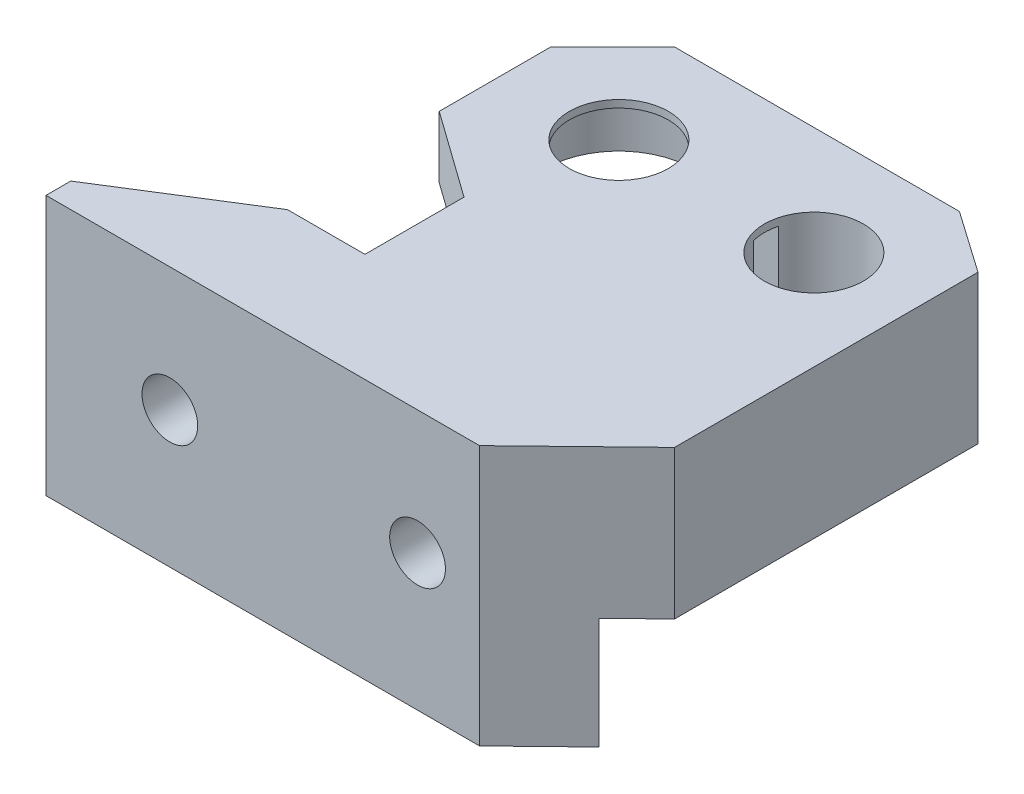
ISO-10303-21;
HEADER;
FILE_DESCRIPTION(('STEP AP214'),'2;1');
FILE_NAME('part.step','',(''),(''),'','','');
FILE_SCHEMA(('AUTOMOTIVE_DESIGN { 1 0 10303 214 1 1 1 1 }'));
ENDSEC;
DATA;
#1=APPLICATION_CONTEXT('core data for automotive mechanical design processes');
#2=APPLICATION_PROTOCOL_DEFINITION('international standard','automotive_design',2000,#1);
#3=PRODUCT_CONTEXT('',#1,'mechanical');
#4=PRODUCT('Part','Part','',(#3));
#5=PRODUCT_RELATED_PRODUCT_CATEGORY('part','',(#4));
#6=PRODUCT_DEFINITION_FORMATION('','',#4);
#7=PRODUCT_DEFINITION_CONTEXT('part definition',#1,'design');
#8=PRODUCT_DEFINITION('design','',#6,#7);
#9=PRODUCT_DEFINITION_SHAPE('','',#8);
#10=(LENGTH_UNIT() NAMED_UNIT(*) SI_UNIT(.MILLI.,.METRE.));
#11=(NAMED_UNIT(*) PLANE_ANGLE_UNIT() SI_UNIT($,.RADIAN.));
#12=(NAMED_UNIT(*) SI_UNIT($,.STERADIAN.) SOLID_ANGLE_UNIT());
#13=UNCERTAINTY_MEASURE_WITH_UNIT(LENGTH_MEASURE(1.E-05),#10,'distance_accuracy_value','');
#14=(GEOMETRIC_REPRESENTATION_CONTEXT(3) GLOBAL_UNCERTAINTY_ASSIGNED_CONTEXT((#13)) GLOBAL_UNIT_ASSIGNED_CONTEXT((#10,
#11,#12)) REPRESENTATION_CONTEXT('',''));
#15=CARTESIAN_POINT('',(0.,0.,0.));
#16=DIRECTION('',(0.,0.,1.));
#17=DIRECTION('',(1.,0.,0.));
#18=AXIS2_PLACEMENT_3D('',#15,#16,#17);
#19=CARTESIAN_POINT('',(-9.25,-5.,-8.75));
#20=DIRECTION('',(0.,0.,1.));
#21=DIRECTION('',(1.,0.,0.));
#22=AXIS2_PLACEMENT_3D('',#19,#20,#21);
#23=CYLINDRICAL_SURFACE('',#22,2.25);
#24=CARTESIAN_POINT('',(-9.25,-5.,27.));
#25=DIRECTION('',(0.,0.,1.));
#26=DIRECTION('',(1.,0.,0.));
#27=AXIS2_PLACEMENT_3D('',#24,#25,#26);
#28=CIRCLE('',#27,2.25);
#29=CARTESIAN_POINT('',(-7.,-5.,27.));
#30=VERTEX_POINT('',#29);
#31=EDGE_CURVE('E582',#30,#30,#28,.T.);
#32=ORIENTED_EDGE('',*,*,#31,.T.);
#33=EDGE_LOOP('',(#32));
#34=FACE_BOUND('',#33,.T.);
#35=CARTESIAN_POINT('',(-9.25,-5.,22.25));
#36=DIRECTION('',(0.,0.,1.));
#37=DIRECTION('',(1.,0.,0.));
#38=AXIS2_PLACEMENT_3D('',#35,#36,#37);
#39=CIRCLE('',#38,2.25);
#40=CARTESIAN_POINT('',(-7.,-5.,22.25));
#41=VERTEX_POINT('',#40);
#42=EDGE_CURVE('E43',#41,#41,#39,.T.);
#43=ORIENTED_EDGE('',*,*,#42,.F.);
#44=EDGE_LOOP('',(#43));
#45=FACE_BOUND('',#44,.T.);
#46=ADVANCED_FACE('F35',(#34,#45),#23,.F.);
#47=CARTESIAN_POINT('',(10.75,-5.,-8.75));
#48=DIRECTION('',(0.,0.,1.));
#49=DIRECTION('',(1.,0.,0.));
#50=AXIS2_PLACEMENT_3D('',#47,#48,#49);
#51=CYLINDRICAL_SURFACE('',#50,2.25);
#52=CARTESIAN_POINT('',(10.75,-5.,27.));
#53=DIRECTION('',(0.,0.,1.));
#54=DIRECTION('',(1.,0.,0.));
#55=AXIS2_PLACEMENT_3D('',#52,#53,#54);
#56=CIRCLE('',#55,2.25);
#57=CARTESIAN_POINT('',(13.,-5.,27.));
#58=VERTEX_POINT('',#57);
#59=EDGE_CURVE('E583',#58,#58,#56,.T.);
#60=ORIENTED_EDGE('',*,*,#59,.T.);
#61=EDGE_LOOP('',(#60));
#62=FACE_BOUND('',#61,.T.);
#63=CARTESIAN_POINT('',(10.75,-5.,22.25));
#64=DIRECTION('',(0.,0.,1.));
#65=DIRECTION('',(1.,0.,0.));
#66=AXIS2_PLACEMENT_3D('',#63,#64,#65);
#67=CIRCLE('',#66,2.25);
#68=CARTESIAN_POINT('',(13.,-5.,22.25));
#69=VERTEX_POINT('',#68);
#70=EDGE_CURVE('E11',#69,#69,#67,.T.);
#71=ORIENTED_EDGE('',*,*,#70,.F.);
#72=EDGE_LOOP('',(#71));
#73=FACE_BOUND('',#72,.T.);
#74=ADVANCED_FACE('F376',(#62,#73),#51,.F.);
#75=CARTESIAN_POINT('',(0.,-7.,0.));
#76=DIRECTION('',(0.,1.,0.));
#77=DIRECTION('',(0.,0.,1.));
#78=AXIS2_PLACEMENT_3D('',#75,#76,#77);
#79=PLANE('',#78);
#80=DIRECTION('',(1.,0.,0.));
#81=VECTOR('',#80,1.);
#82=CARTESIAN_POINT('',(20.25,-7.,18.25));
#83=LINE('',#82,#81);
#84=CARTESIAN_POINT('',(-5.78589838486224,-7.,18.25));
#85=VERTEX_POINT('',#84);
#86=CARTESIAN_POINT('',(7.28589838486225,-7.,18.25));
#87=VERTEX_POINT('',#86);
#88=EDGE_CURVE('E251',#85,#87,#83,.T.);
#89=ORIENTED_EDGE('',*,*,#88,.T.);
#90=DIRECTION('',(0.,0.,-1.));
#91=VECTOR('',#90,1.);
#92=CARTESIAN_POINT('',(7.28589838486225,-7.,22.25));
#93=LINE('',#92,#91);
#94=CARTESIAN_POINT('',(7.28589838486225,-7.,22.25));
#95=VERTEX_POINT('',#94);
#96=EDGE_CURVE('E229',#87,#95,#93,.F.);
#97=ORIENTED_EDGE('',*,*,#96,.T.);
#98=DIRECTION('',(-1.,0.,0.));
#99=VECTOR('',#98,1.);
#100=CARTESIAN_POINT('',(-14.8703703703704,-7.,22.25));
#101=LINE('',#100,#99);
#102=CARTESIAN_POINT('',(-5.78589838486224,-7.,22.25));
#103=VERTEX_POINT('',#102);
#104=EDGE_CURVE('E557',#95,#103,#101,.T.);
#105=ORIENTED_EDGE('',*,*,#104,.T.);
#106=DIRECTION('',(0.,0.,-1.));
#107=VECTOR('',#106,1.);
#108=CARTESIAN_POINT('',(-5.78589838486224,-7.,22.25));
#109=LINE('',#108,#107);
#110=EDGE_CURVE('E244',#103,#85,#109,.T.);
#111=ORIENTED_EDGE('',*,*,#110,.T.);
#112=EDGE_LOOP('',(#89,#97,#105,#111));
#113=FACE_BOUND('',#112,.T.);
#114=ADVANCED_FACE('F382',(#113),#79,.F.);
#115=DIRECTION('',(0.846889988853068,0.,-0.531768132535647));
#116=VECTOR('',#115,1.);
#117=CARTESIAN_POINT('',(-8.5,-7.,18.25));
#118=LINE('',#117,#116);
#119=CARTESIAN_POINT('',(-14.8703703703704,-7.,22.25));
#120=VERTEX_POINT('',#119);
#121=CARTESIAN_POINT('',(-12.7141016151378,-7.,20.8960638048539));
#122=VERTEX_POINT('',#121);
#123=EDGE_CURVE('E252',#120,#122,#118,.T.);
#124=ORIENTED_EDGE('',*,*,#123,.T.);
#125=DIRECTION('',(0.,0.,-1.));
#126=VECTOR('',#125,1.);
#127=CARTESIAN_POINT('',(-12.7141016151378,-7.,22.25));
#128=LINE('',#127,#126);
#129=CARTESIAN_POINT('',(-12.7141016151378,-7.,22.25));
#130=VERTEX_POINT('',#129);
#131=EDGE_CURVE('E563',#122,#130,#128,.F.);
#132=ORIENTED_EDGE('',*,*,#131,.T.);
#133=EDGE_CURVE('E556',#130,#120,#101,.T.);
#134=ORIENTED_EDGE('',*,*,#133,.T.);
#135=EDGE_LOOP('',(#124,#132,#134));
#136=FACE_BOUND('',#135,.T.);
#137=ADVANCED_FACE('F424',(#136),#79,.F.);
#138=CARTESIAN_POINT('',(15.75,5.,0.));
#139=DIRECTION('',(0.,-1.,0.));
#140=DIRECTION('',(0.,0.,-1.));
#141=AXIS2_PLACEMENT_3D('',#138,#139,#140);
#142=CYLINDRICAL_SURFACE('',#141,4.);
#143=CARTESIAN_POINT('',(15.75,5.,0.));
#144=DIRECTION('',(0.,1.,0.));
#145=DIRECTION('',(0.,0.,1.));
#146=AXIS2_PLACEMENT_3D('',#143,#144,#145);
#147=CIRCLE('',#146,4.);
#148=CARTESIAN_POINT('',(15.75,5.,4.));
#149=VERTEX_POINT('',#148);
#150=EDGE_CURVE('E282',#149,#149,#147,.T.);
#151=ORIENTED_EDGE('',*,*,#150,.T.);
#152=EDGE_LOOP('',(#151));
#153=FACE_BOUND('',#152,.T.);
#154=DIRECTION('',(0.,-1.,0.));
#155=VECTOR('',#154,1.);
#156=CARTESIAN_POINT('',(11.8770166537926,5.,-1.));
#157=LINE('',#156,#155);
#158=CARTESIAN_POINT('',(11.8770166537926,-2.5,-1.));
#159=VERTEX_POINT('',#158);
#160=CARTESIAN_POINT('',(11.8770166537926,4.4,-1.));
#161=VERTEX_POINT('',#160);
#162=EDGE_CURVE('E363',#159,#161,#157,.F.);
#163=ORIENTED_EDGE('',*,*,#162,.F.);
#164=CARTESIAN_POINT('',(15.75,-2.5,0.));
#165=DIRECTION('',(0.,-1.,0.));
#166=DIRECTION('',(0.,0.,-1.));
#167=AXIS2_PLACEMENT_3D('',#164,#165,#166);
#168=CIRCLE('',#167,4.);
#169=CARTESIAN_POINT('',(11.8770166537926,-2.5,0.999999999999999));
#170=VERTEX_POINT('',#169);
#171=EDGE_CURVE('E525',#159,#170,#168,.T.);
#172=ORIENTED_EDGE('',*,*,#171,.T.);
#173=DIRECTION('',(0.,-1.,0.));
#174=VECTOR('',#173,1.);
#175=CARTESIAN_POINT('',(11.8770166537926,5.,1.));
#176=LINE('',#175,#174);
#177=CARTESIAN_POINT('',(11.8770166537926,4.4,1.));
#178=VERTEX_POINT('',#177);
#179=EDGE_CURVE('E365',#178,#170,#176,.T.);
#180=ORIENTED_EDGE('',*,*,#179,.F.);
#181=CARTESIAN_POINT('',(15.75,4.4,0.));
#182=DIRECTION('',(0.,-1.,0.));
#183=DIRECTION('',(0.,0.,-1.));
#184=AXIS2_PLACEMENT_3D('',#181,#182,#183);
#185=CIRCLE('',#184,4.);
#186=EDGE_CURVE('E367',#178,#161,#185,.T.);
#187=ORIENTED_EDGE('',*,*,#186,.T.);
#188=EDGE_LOOP('',(#163,#172,#180,#187));
#189=FACE_BOUND('',#188,.T.);
#190=ADVANCED_FACE('F409',(#153,#189),#142,.F.);
#191=CARTESIAN_POINT('',(15.75,-2.5,0.));
#192=DIRECTION('',(0.,-1.,0.));
#193=DIRECTION('',(0.,0.,-1.));
#194=AXIS2_PLACEMENT_3D('',#191,#192,#193);
#195=PLANE('',#194);
#196=ORIENTED_EDGE('',*,*,#171,.F.);
#197=DIRECTION('',(-1.,0.,0.));
#198=VECTOR('',#197,1.);
#199=CARTESIAN_POINT('',(15.75,-2.5,-1.));
#200=LINE('',#199,#198);
#201=CARTESIAN_POINT('',(8.82179676972449,-2.5,-1.));
#202=VERTEX_POINT('',#201);
#203=EDGE_CURVE('E594',#159,#202,#200,.T.);
#204=ORIENTED_EDGE('',*,*,#203,.T.);
#205=CARTESIAN_POINT('',(15.75,-2.5,0.));
#206=DIRECTION('',(0.,-1.,0.));
#207=DIRECTION('',(0.,0.,-1.));
#208=AXIS2_PLACEMENT_3D('',#205,#206,#207);
#209=CIRCLE('',#208,7.);
#210=CARTESIAN_POINT('',(20.380064794363,-2.5,-5.25));
#211=VERTEX_POINT('',#210);
#212=EDGE_CURVE('E527',#202,#211,#209,.T.);
#213=ORIENTED_EDGE('',*,*,#212,.T.);
#214=DIRECTION('',(1.,0.,0.));
#215=VECTOR('',#214,1.);
#216=CARTESIAN_POINT('',(23.75,-2.5,-5.25));
#217=LINE('',#216,#215);
#218=CARTESIAN_POINT('',(20.25,-2.5,-5.25));
#219=VERTEX_POINT('',#218);
#220=EDGE_CURVE('E360',#219,#211,#217,.T.);
#221=ORIENTED_EDGE('',*,*,#220,.F.);
#222=DIRECTION('',(0.,0.,-1.));
#223=VECTOR('',#222,1.);
#224=CARTESIAN_POINT('',(20.25,-2.5,-5.25));
#225=LINE('',#224,#223);
#226=CARTESIAN_POINT('',(20.25,-2.5,5.3619026473818));
#227=VERTEX_POINT('',#226);
#228=EDGE_CURVE('E535',#227,#219,#225,.T.);
#229=ORIENTED_EDGE('',*,*,#228,.F.);
#230=CARTESIAN_POINT('',(8.82179676972449,-2.5,1.));
#231=VERTEX_POINT('',#230);
#232=EDGE_CURVE('E533',#227,#231,#209,.T.);
#233=ORIENTED_EDGE('',*,*,#232,.T.);
#234=DIRECTION('',(1.,0.,0.));
#235=VECTOR('',#234,1.);
#236=CARTESIAN_POINT('',(15.75,-2.5,0.999999999999999));
#237=LINE('',#236,#235);
#238=EDGE_CURVE('E589',#231,#170,#237,.T.);
#239=ORIENTED_EDGE('',*,*,#238,.T.);
#240=EDGE_LOOP('',(#196,#204,#213,#221,#229,#233,#239));
#241=FACE_BOUND('',#240,.T.);
#242=ADVANCED_FACE('F405',(#241),#195,.T.);
#243=CARTESIAN_POINT('',(15.75,-2.5,0.));
#244=DIRECTION('',(0.,1.,0.));
#245=DIRECTION('',(0.,0.,1.));
#246=AXIS2_PLACEMENT_3D('',#243,#244,#245);
#247=CYLINDRICAL_SURFACE('',#246,7.);
#248=DIRECTION('',(0.,1.,0.));
#249=VECTOR('',#248,1.);
#250=CARTESIAN_POINT('',(8.82179676972449,-2.5,-1.));
#251=LINE('',#250,#249);
#252=CARTESIAN_POINT('',(8.82179676972449,0.,-1.));
#253=VERTEX_POINT('',#252);
#254=EDGE_CURVE('E592',#253,#202,#251,.F.);
#255=ORIENTED_EDGE('',*,*,#254,.F.);
#256=CARTESIAN_POINT('',(15.75,0.,0.));
#257=DIRECTION('',(0.,-1.,0.));
#258=DIRECTION('',(0.,0.,-1.));
#259=AXIS2_PLACEMENT_3D('',#256,#257,#258);
#260=CIRCLE('',#259,7.);
#261=CARTESIAN_POINT('',(20.380064794363,0.,-5.25));
#262=VERTEX_POINT('',#261);
#263=EDGE_CURVE('E522',#253,#262,#260,.T.);
#264=ORIENTED_EDGE('',*,*,#263,.T.);
#265=DIRECTION('',(0.,1.,0.));
#266=VECTOR('',#265,1.);
#267=CARTESIAN_POINT('',(20.380064794363,-2.5,-5.25));
#268=LINE('',#267,#266);
#269=EDGE_CURVE('E268',#262,#211,#268,.F.);
#270=ORIENTED_EDGE('',*,*,#269,.T.);
#271=ORIENTED_EDGE('',*,*,#212,.F.);
#272=EDGE_LOOP('',(#255,#264,#270,#271));
#273=FACE_BOUND('',#272,.T.);
#274=ADVANCED_FACE('F408',(#273),#247,.T.);
#275=DIRECTION('',(0.,1.,0.));
#276=VECTOR('',#275,1.);
#277=CARTESIAN_POINT('',(8.82179676972449,-2.5,1.));
#278=LINE('',#277,#276);
#279=CARTESIAN_POINT('',(8.82179676972449,0.,1.));
#280=VERTEX_POINT('',#279);
#281=EDGE_CURVE('E586',#231,#280,#278,.T.);
#282=ORIENTED_EDGE('',*,*,#281,.F.);
#283=ORIENTED_EDGE('',*,*,#232,.F.);
#284=DIRECTION('',(0.,1.,0.));
#285=VECTOR('',#284,1.);
#286=CARTESIAN_POINT('',(20.25,-2.5,5.3619026473818));
#287=LINE('',#286,#285);
#288=CARTESIAN_POINT('',(20.25,0.,5.3619026473818));
#289=VERTEX_POINT('',#288);
#290=EDGE_CURVE('E50',#227,#289,#287,.T.);
#291=ORIENTED_EDGE('',*,*,#290,.T.);
#292=EDGE_CURVE('E58',#289,#280,#260,.T.);
#293=ORIENTED_EDGE('',*,*,#292,.T.);
#294=EDGE_LOOP('',(#282,#283,#291,#293));
#295=FACE_BOUND('',#294,.T.);
#296=ADVANCED_FACE('F413',(#295),#247,.T.);
#297=CARTESIAN_POINT('',(0.,5.,0.));
#298=DIRECTION('',(0.,-1.,0.));
#299=DIRECTION('',(0.,0.,-1.));
#300=AXIS2_PLACEMENT_3D('',#297,#298,#299);
#301=CYLINDRICAL_SURFACE('',#300,4.);
#302=CARTESIAN_POINT('',(0.,5.,0.));
#303=DIRECTION('',(0.,1.,0.));
#304=DIRECTION('',(0.,0.,1.));
#305=AXIS2_PLACEMENT_3D('',#302,#303,#304);
#306=CIRCLE('',#305,4.);
#307=CARTESIAN_POINT('',(0.,5.,4.));
#308=VERTEX_POINT('',#307);
#309=EDGE_CURVE('E285',#308,#308,#306,.T.);
#310=ORIENTED_EDGE('',*,*,#309,.T.);
#311=EDGE_LOOP('',(#310));
#312=FACE_BOUND('',#311,.T.);
#313=CARTESIAN_POINT('',(0.,4.4,0.));
#314=DIRECTION('',(0.,-1.,0.));
#315=DIRECTION('',(0.,0.,-1.));
#316=AXIS2_PLACEMENT_3D('',#313,#314,#315);
#317=CIRCLE('',#316,4.);
#318=CARTESIAN_POINT('',(0.,4.4,-4.));
#319=VERTEX_POINT('',#318);
#320=EDGE_CURVE('E529',#319,#319,#317,.T.);
#321=ORIENTED_EDGE('',*,*,#320,.T.);
#322=EDGE_LOOP('',(#321));
#323=FACE_BOUND('',#322,.T.);
#324=ADVANCED_FACE('F435',(#312,#323),#301,.F.);
#325=CARTESIAN_POINT('',(0.,0.,0.));
#326=DIRECTION('',(0.,1.,0.));
#327=DIRECTION('',(0.,0.,1.));
#328=AXIS2_PLACEMENT_3D('',#325,#326,#327);
#329=PLANE('',#328);
#330=CARTESIAN_POINT('',(0.,0.,0.));
#331=DIRECTION('',(0.,-1.,0.));
#332=DIRECTION('',(0.,0.,-1.));
#333=AXIS2_PLACEMENT_3D('',#330,#331,#332);
#334=CIRCLE('',#333,5.96815667340306);
#335=CARTESIAN_POINT('',(5.88378229358339,0.,1.));
#336=VERTEX_POINT('',#335);
#337=CARTESIAN_POINT('',(5.88378229358339,0.,-1.));
#338=VERTEX_POINT('',#337);
#339=EDGE_CURVE('E597',#336,#338,#334,.T.);
#340=ORIENTED_EDGE('',*,*,#339,.F.);
#341=DIRECTION('',(-1.,0.,0.));
#342=VECTOR('',#341,1.);
#343=CARTESIAN_POINT('',(5.88378229358339,0.,1.));
#344=LINE('',#343,#342);
#345=EDGE_CURVE('E602',#280,#336,#344,.T.);
#346=ORIENTED_EDGE('',*,*,#345,.F.);
#347=ORIENTED_EDGE('',*,*,#292,.F.);
#348=DIRECTION('',(0.,0.,-1.));
#349=VECTOR('',#348,1.);
#350=CARTESIAN_POINT('',(20.25,0.,-5.25));
#351=LINE('',#350,#349);
#352=CARTESIAN_POINT('',(20.25,0.,18.25));
#353=VERTEX_POINT('',#352);
#354=EDGE_CURVE('E270',#353,#289,#351,.T.);
#355=ORIENTED_EDGE('',*,*,#354,.F.);
#356=DIRECTION('',(1.,0.,0.));
#357=VECTOR('',#356,1.);
#358=CARTESIAN_POINT('',(20.25,0.,18.25));
#359=LINE('',#358,#357);
#360=CARTESIAN_POINT('',(-2.25,0.,18.25));
#361=VERTEX_POINT('',#360);
#362=EDGE_CURVE('E266',#361,#353,#359,.T.);
#363=ORIENTED_EDGE('',*,*,#362,.F.);
#364=DIRECTION('',(0.,0.,1.));
#365=VECTOR('',#364,1.);
#366=CARTESIAN_POINT('',(-2.25,0.,18.25));
#367=LINE('',#366,#365);
#368=CARTESIAN_POINT('',(-2.25,0.,10.25));
#369=VERTEX_POINT('',#368);
#370=EDGE_CURVE('E322',#369,#361,#367,.T.);
#371=ORIENTED_EDGE('',*,*,#370,.F.);
#372=DIRECTION('',(0.813733471206735,0.,0.581238193719096));
#373=VECTOR('',#372,1.);
#374=CARTESIAN_POINT('',(-2.25,0.,10.25));
#375=LINE('',#374,#373);
#376=CARTESIAN_POINT('',(-9.25,0.,5.25));
#377=VERTEX_POINT('',#376);
#378=EDGE_CURVE('E320',#377,#369,#375,.T.);
#379=ORIENTED_EDGE('',*,*,#378,.F.);
#380=DIRECTION('',(0.,0.,1.));
#381=VECTOR('',#380,1.);
#382=CARTESIAN_POINT('',(-9.25,0.,5.25));
#383=LINE('',#382,#381);
#384=CARTESIAN_POINT('',(-9.25,0.,-3.75));
#385=VERTEX_POINT('',#384);
#386=EDGE_CURVE('E318',#385,#377,#383,.T.);
#387=ORIENTED_EDGE('',*,*,#386,.F.);
#388=DIRECTION('',(-0.707106781186548,0.,0.707106781186547));
#389=VECTOR('',#388,1.);
#390=CARTESIAN_POINT('',(-9.25,0.,-3.75));
#391=LINE('',#390,#389);
#392=CARTESIAN_POINT('',(-4.25,0.,-8.75));
#393=VERTEX_POINT('',#392);
#394=EDGE_CURVE('E288',#393,#385,#391,.T.);
#395=ORIENTED_EDGE('',*,*,#394,.F.);
#396=DIRECTION('',(-1.,0.,0.));
#397=VECTOR('',#396,1.);
#398=CARTESIAN_POINT('',(-4.25,0.,-8.75));
#399=LINE('',#398,#397);
#400=CARTESIAN_POINT('',(18.75,0.,-8.75));
#401=VERTEX_POINT('',#400);
#402=EDGE_CURVE('E293',#401,#393,#399,.T.);
#403=ORIENTED_EDGE('',*,*,#402,.F.);
#404=DIRECTION('',(-0.819231920519041,0.,-0.573462344363328));
#405=VECTOR('',#404,1.);
#406=CARTESIAN_POINT('',(18.75,0.,-8.75));
#407=LINE('',#406,#405);
#408=CARTESIAN_POINT('',(23.75,0.,-5.25));
#409=VERTEX_POINT('',#408);
#410=EDGE_CURVE('E325',#409,#401,#407,.T.);
#411=ORIENTED_EDGE('',*,*,#410,.F.);
#412=DIRECTION('',(1.,0.,0.));
#413=VECTOR('',#412,1.);
#414=CARTESIAN_POINT('',(23.75,0.,-5.25));
#415=LINE('',#414,#413);
#416=EDGE_CURVE('E272',#262,#409,#415,.T.);
#417=ORIENTED_EDGE('',*,*,#416,.F.);
#418=ORIENTED_EDGE('',*,*,#263,.F.);
#419=DIRECTION('',(1.,0.,0.));
#420=VECTOR('',#419,1.);
#421=CARTESIAN_POINT('',(5.88378229358339,0.,-1.));
#422=LINE('',#421,#420);
#423=EDGE_CURVE('E524',#338,#253,#422,.T.);
#424=ORIENTED_EDGE('',*,*,#423,.F.);
#425=EDGE_LOOP('',(#340,#346,#347,#355,#363,#371,#379,#387,#395,#403,#411,#417,#418,#424));
#426=FACE_BOUND('',#425,.T.);
#427=ADVANCED_FACE('F438',(#426),#329,.F.);
#428=CARTESIAN_POINT('',(0.,5.,0.));
#429=DIRECTION('',(0.,1.,0.));
#430=DIRECTION('',(0.,0.,1.));
#431=AXIS2_PLACEMENT_3D('',#428,#429,#430);
#432=PLANE('',#431);
#433=ORIENTED_EDGE('',*,*,#309,.F.);
#434=EDGE_LOOP('',(#433));
#435=FACE_BOUND('',#434,.T.);
#436=DIRECTION('',(-0.707106781186548,0.,0.707106781186547));
#437=VECTOR('',#436,1.);
#438=CARTESIAN_POINT('',(-9.25,5.,-3.75));
#439=LINE('',#438,#437);
#440=CARTESIAN_POINT('',(-4.25,5.,-8.75));
#441=VERTEX_POINT('',#440);
#442=CARTESIAN_POINT('',(-9.25,5.,-3.75));
#443=VERTEX_POINT('',#442);
#444=EDGE_CURVE('E289',#441,#443,#439,.T.);
#445=ORIENTED_EDGE('',*,*,#444,.T.);
#446=DIRECTION('',(0.,0.,1.));
#447=VECTOR('',#446,1.);
#448=CARTESIAN_POINT('',(-9.25,5.,5.25));
#449=LINE('',#448,#447);
#450=CARTESIAN_POINT('',(-9.25,5.,5.25));
#451=VERTEX_POINT('',#450);
#452=EDGE_CURVE('E292',#443,#451,#449,.T.);
#453=ORIENTED_EDGE('',*,*,#452,.T.);
#454=DIRECTION('',(0.813733471206735,0.,0.581238193719096));
#455=VECTOR('',#454,1.);
#456=CARTESIAN_POINT('',(-2.25,5.,10.25));
#457=LINE('',#456,#455);
#458=CARTESIAN_POINT('',(-2.25,5.,10.25));
#459=VERTEX_POINT('',#458);
#460=EDGE_CURVE('E295',#451,#459,#457,.T.);
#461=ORIENTED_EDGE('',*,*,#460,.T.);
#462=DIRECTION('',(0.,0.,1.));
#463=VECTOR('',#462,1.);
#464=CARTESIAN_POINT('',(-2.25,5.,18.25));
#465=LINE('',#464,#463);
#466=CARTESIAN_POINT('',(-2.25,5.,18.25));
#467=VERTEX_POINT('',#466);
#468=EDGE_CURVE('E297',#459,#467,#465,.T.);
#469=ORIENTED_EDGE('',*,*,#468,.T.);
#470=DIRECTION('',(-1.,0.,0.));
#471=VECTOR('',#470,1.);
#472=CARTESIAN_POINT('',(-8.5,5.,18.25));
#473=LINE('',#472,#471);
#474=CARTESIAN_POINT('',(-8.5,5.,18.25));
#475=VERTEX_POINT('',#474);
#476=EDGE_CURVE('E299',#467,#475,#473,.T.);
#477=ORIENTED_EDGE('',*,*,#476,.T.);
#478=DIRECTION('',(-0.846889988853068,0.,0.531768132535647));
#479=VECTOR('',#478,1.);
#480=CARTESIAN_POINT('',(-19.25,5.,25.));
#481=LINE('',#480,#479);
#482=CARTESIAN_POINT('',(-19.25,5.,25.));
#483=VERTEX_POINT('',#482);
#484=EDGE_CURVE('E301',#475,#483,#481,.T.);
#485=ORIENTED_EDGE('',*,*,#484,.T.);
#486=DIRECTION('',(0.,0.,1.));
#487=VECTOR('',#486,1.);
#488=CARTESIAN_POINT('',(-19.25,5.,27.));
#489=LINE('',#488,#487);
#490=CARTESIAN_POINT('',(-19.25,5.,27.));
#491=VERTEX_POINT('',#490);
#492=EDGE_CURVE('E303',#483,#491,#489,.T.);
#493=ORIENTED_EDGE('',*,*,#492,.T.);
#494=DIRECTION('',(1.,0.,0.));
#495=VECTOR('',#494,1.);
#496=CARTESIAN_POINT('',(15.75,5.,27.));
#497=LINE('',#496,#495);
#498=CARTESIAN_POINT('',(15.75,5.,27.));
#499=VERTEX_POINT('',#498);
#500=EDGE_CURVE('E305',#491,#499,#497,.T.);
#501=ORIENTED_EDGE('',*,*,#500,.T.);
#502=DIRECTION('',(0.718240222789174,0.,-0.695795215827012));
#503=VECTOR('',#502,1.);
#504=CARTESIAN_POINT('',(23.75,5.,19.25));
#505=LINE('',#504,#503);
#506=CARTESIAN_POINT('',(23.75,5.,19.25));
#507=VERTEX_POINT('',#506);
#508=EDGE_CURVE('E307',#499,#507,#505,.T.);
#509=ORIENTED_EDGE('',*,*,#508,.T.);
#510=DIRECTION('',(0.,0.,-1.));
#511=VECTOR('',#510,1.);
#512=CARTESIAN_POINT('',(23.75,5.,-5.25));
#513=LINE('',#512,#511);
#514=CARTESIAN_POINT('',(23.75,5.,-5.25));
#515=VERTEX_POINT('',#514);
#516=EDGE_CURVE('E309',#507,#515,#513,.T.);
#517=ORIENTED_EDGE('',*,*,#516,.T.);
#518=DIRECTION('',(-0.819231920519041,0.,-0.573462344363328));
#519=VECTOR('',#518,1.);
#520=CARTESIAN_POINT('',(18.75,5.,-8.75));
#521=LINE('',#520,#519);
#522=CARTESIAN_POINT('',(18.75,5.,-8.75));
#523=VERTEX_POINT('',#522);
#524=EDGE_CURVE('E311',#515,#523,#521,.T.);
#525=ORIENTED_EDGE('',*,*,#524,.T.);
#526=DIRECTION('',(-1.,0.,0.));
#527=VECTOR('',#526,1.);
#528=CARTESIAN_POINT('',(-4.25,5.,-8.75));
#529=LINE('',#528,#527);
#530=EDGE_CURVE('E313',#523,#441,#529,.T.);
#531=ORIENTED_EDGE('',*,*,#530,.T.);
#532=EDGE_LOOP('',(#445,#453,#461,#469,#477,#485,#493,#501,#509,#517,#525,#531));
#533=FACE_BOUND('',#532,.T.);
#534=ORIENTED_EDGE('',*,*,#150,.F.);
#535=EDGE_LOOP('',(#534));
#536=FACE_BOUND('',#535,.T.);
#537=ADVANCED_FACE('F440',(#435,#533,#536),#432,.T.);
#538=CARTESIAN_POINT('',(-9.25,5.,-3.75));
#539=DIRECTION('',(0.707106781186547,0.,0.707106781186548));
#540=DIRECTION('',(0.707106781186548,0.,-0.707106781186547));
#541=AXIS2_PLACEMENT_3D('',#538,#539,#540);
#542=PLANE('',#541);
#543=ORIENTED_EDGE('',*,*,#394,.T.);
#544=DIRECTION('',(0.,-1.,0.));
#545=VECTOR('',#544,1.);
#546=CARTESIAN_POINT('',(-9.25,5.,-3.75));
#547=LINE('',#546,#545);
#548=EDGE_CURVE('E269',#443,#385,#547,.T.);
#549=ORIENTED_EDGE('',*,*,#548,.F.);
#550=ORIENTED_EDGE('',*,*,#444,.F.);
#551=DIRECTION('',(0.,-1.,0.));
#552=VECTOR('',#551,1.);
#553=CARTESIAN_POINT('',(-4.25,5.,-8.75));
#554=LINE('',#553,#552);
#555=EDGE_CURVE('E315',#441,#393,#554,.T.);
#556=ORIENTED_EDGE('',*,*,#555,.T.);
#557=EDGE_LOOP('',(#543,#549,#550,#556));
#558=FACE_BOUND('',#557,.T.);
#559=ADVANCED_FACE('F37',(#558),#542,.F.);
#560=CARTESIAN_POINT('',(-9.25,5.,5.25));
#561=DIRECTION('',(1.,0.,0.));
#562=DIRECTION('',(0.,0.,-1.));
#563=AXIS2_PLACEMENT_3D('',#560,#561,#562);
#564=PLANE('',#563);
#565=ORIENTED_EDGE('',*,*,#386,.T.);
#566=DIRECTION('',(0.,-1.,0.));
#567=VECTOR('',#566,1.);
#568=CARTESIAN_POINT('',(-9.25,5.,5.25));
#569=LINE('',#568,#567);
#570=EDGE_CURVE('E353',#451,#377,#569,.T.);
#571=ORIENTED_EDGE('',*,*,#570,.F.);
#572=ORIENTED_EDGE('',*,*,#452,.F.);
#573=ORIENTED_EDGE('',*,*,#548,.T.);
#574=EDGE_LOOP('',(#565,#571,#572,#573));
#575=FACE_BOUND('',#574,.T.);
#576=ADVANCED_FACE('F481',(#575),#564,.F.);
#577=CARTESIAN_POINT('',(-2.25,5.,10.25));
#578=DIRECTION('',(0.581238193719096,0.,-0.813733471206735));
#579=DIRECTION('',(-0.813733471206735,0.,-0.581238193719096));
#580=AXIS2_PLACEMENT_3D('',#577,#578,#579);
#581=PLANE('',#580);
#582=ORIENTED_EDGE('',*,*,#378,.T.);
#583=DIRECTION('',(0.,-1.,0.));
#584=VECTOR('',#583,1.);
#585=CARTESIAN_POINT('',(-2.25,5.,10.25));
#586=LINE('',#585,#584);
#587=EDGE_CURVE('E350',#459,#369,#586,.T.);
#588=ORIENTED_EDGE('',*,*,#587,.F.);
#589=ORIENTED_EDGE('',*,*,#460,.F.);
#590=ORIENTED_EDGE('',*,*,#570,.T.);
#591=EDGE_LOOP('',(#582,#588,#589,#590));
#592=FACE_BOUND('',#591,.T.);
#593=ADVANCED_FACE('F478',(#592),#581,.F.);
#594=CARTESIAN_POINT('',(-2.25,5.,18.25));
#595=DIRECTION('',(1.,0.,0.));
#596=DIRECTION('',(0.,0.,-1.));
#597=AXIS2_PLACEMENT_3D('',#594,#595,#596);
#598=PLANE('',#597);
#599=ORIENTED_EDGE('',*,*,#370,.T.);
#600=DIRECTION('',(0.,-1.,0.));
#601=VECTOR('',#600,1.);
#602=CARTESIAN_POINT('',(-2.25,5.,18.25));
#603=LINE('',#602,#601);
#604=EDGE_CURVE('E347',#467,#361,#603,.T.);
#605=ORIENTED_EDGE('',*,*,#604,.F.);
#606=ORIENTED_EDGE('',*,*,#468,.F.);
#607=ORIENTED_EDGE('',*,*,#587,.T.);
#608=EDGE_LOOP('',(#599,#605,#606,#607));
#609=FACE_BOUND('',#608,.T.);
#610=ADVANCED_FACE('F475',(#609),#598,.F.);
#611=CARTESIAN_POINT('',(-8.5,5.,18.25));
#612=DIRECTION('',(0.,0.,1.));
#613=DIRECTION('',(1.,0.,0.));
#614=AXIS2_PLACEMENT_3D('',#611,#612,#613);
#615=PLANE('',#614);
#616=CARTESIAN_POINT('',(14.2141016151378,-7.,18.25));
#617=VERTEX_POINT('',#616);
#618=CARTESIAN_POINT('',(20.25,-7.,18.25));
#619=VERTEX_POINT('',#618);
#620=EDGE_CURVE('E240',#617,#619,#83,.T.);
#621=ORIENTED_EDGE('',*,*,#620,.F.);
#622=CARTESIAN_POINT('',(10.75,-5.,18.25));
#623=DIRECTION('',(0.,0.,-1.));
#624=DIRECTION('',(-1.,0.,0.));
#625=AXIS2_PLACEMENT_3D('',#622,#623,#624);
#626=CIRCLE('',#625,4.);
#627=EDGE_CURVE('E223',#87,#617,#626,.T.);
#628=ORIENTED_EDGE('',*,*,#627,.F.);
#629=ORIENTED_EDGE('',*,*,#88,.F.);
#630=CARTESIAN_POINT('',(-9.25,-5.,18.25));
#631=DIRECTION('',(0.,0.,-1.));
#632=DIRECTION('',(-1.,0.,0.));
#633=AXIS2_PLACEMENT_3D('',#630,#631,#632);
#634=CIRCLE('',#633,4.);
#635=CARTESIAN_POINT('',(-8.5,-1.07094158862457,18.25));
#636=VERTEX_POINT('',#635);
#637=EDGE_CURVE('E576',#636,#85,#634,.T.);
#638=ORIENTED_EDGE('',*,*,#637,.F.);
#639=DIRECTION('',(0.,-1.,0.));
#640=VECTOR('',#639,1.);
#641=CARTESIAN_POINT('',(-8.5,5.,18.25));
#642=LINE('',#641,#640);
#643=EDGE_CURVE('E344',#475,#636,#642,.T.);
#644=ORIENTED_EDGE('',*,*,#643,.F.);
#645=ORIENTED_EDGE('',*,*,#476,.F.);
#646=ORIENTED_EDGE('',*,*,#604,.T.);
#647=ORIENTED_EDGE('',*,*,#362,.T.);
#648=DIRECTION('',(0.,1.,0.));
#649=VECTOR('',#648,1.);
#650=CARTESIAN_POINT('',(20.25,-7.,18.25));
#651=LINE('',#650,#649);
#652=EDGE_CURVE('E249',#619,#353,#651,.T.);
#653=ORIENTED_EDGE('',*,*,#652,.F.);
#654=EDGE_LOOP('',(#621,#628,#629,#638,#644,#645,#646,#647,#653));
#655=FACE_BOUND('',#654,.T.);
#656=ADVANCED_FACE('F246',(#655),#615,.F.);
#657=CARTESIAN_POINT('',(-19.25,5.,25.));
#658=DIRECTION('',(0.531768132535647,0.,0.846889988853068));
#659=DIRECTION('',(0.846889988853068,0.,-0.531768132535647));
#660=AXIS2_PLACEMENT_3D('',#657,#658,#659);
#661=PLANE('',#660);
#662=ORIENTED_EDGE('',*,*,#643,.T.);
#663=CARTESIAN_POINT('',(-9.25,-5.,18.7209302325581));
#664=DIRECTION('',(0.531768132535647,0.,0.846889988853068));
#665=DIRECTION('',(0.846889988853068,0.,-0.531768132535647));
#666=AXIS2_PLACEMENT_3D('',#663,#664,#665);
#667=ELLIPSE('',#666,4.72316363712971,4.);
#668=EDGE_CURVE('E570',#636,#122,#667,.T.);
#669=ORIENTED_EDGE('',*,*,#668,.T.);
#670=ORIENTED_EDGE('',*,*,#123,.F.);
#671=DIRECTION('',(0.,1.,0.));
#672=VECTOR('',#671,1.);
#673=CARTESIAN_POINT('',(-14.8703703703704,-16.,22.25));
#674=LINE('',#673,#672);
#675=CARTESIAN_POINT('',(-14.8703703703704,-16.,22.25));
#676=VERTEX_POINT('',#675);
#677=EDGE_CURVE('E273',#676,#120,#674,.T.);
#678=ORIENTED_EDGE('',*,*,#677,.F.);
#679=DIRECTION('',(0.846889988853068,0.,-0.531768132535647));
#680=VECTOR('',#679,1.);
#681=CARTESIAN_POINT('',(-19.25,-16.,25.));
#682=LINE('',#681,#680);
#683=CARTESIAN_POINT('',(-19.25,-16.,25.));
#684=VERTEX_POINT('',#683);
#685=EDGE_CURVE('E537',#684,#676,#682,.T.);
#686=ORIENTED_EDGE('',*,*,#685,.F.);
#687=DIRECTION('',(0.,-1.,0.));
#688=VECTOR('',#687,1.);
#689=CARTESIAN_POINT('',(-19.25,5.,25.));
#690=LINE('',#689,#688);
#691=EDGE_CURVE('E342',#483,#684,#690,.T.);
#692=ORIENTED_EDGE('',*,*,#691,.F.);
#693=ORIENTED_EDGE('',*,*,#484,.F.);
#694=EDGE_LOOP('',(#662,#669,#670,#678,#686,#692,#693));
#695=FACE_BOUND('',#694,.T.);
#696=ADVANCED_FACE('F468',(#695),#661,.F.);
#697=CARTESIAN_POINT('',(-19.25,5.,27.));
#698=DIRECTION('',(1.,0.,0.));
#699=DIRECTION('',(0.,0.,-1.));
#700=AXIS2_PLACEMENT_3D('',#697,#698,#699);
#701=PLANE('',#700);
#702=ORIENTED_EDGE('',*,*,#691,.T.);
#703=DIRECTION('',(0.,0.,-1.));
#704=VECTOR('',#703,1.);
#705=CARTESIAN_POINT('',(-19.25,-16.,27.));
#706=LINE('',#705,#704);
#707=CARTESIAN_POINT('',(-19.25,-16.,27.));
#708=VERTEX_POINT('',#707);
#709=EDGE_CURVE('E548',#708,#684,#706,.T.);
#710=ORIENTED_EDGE('',*,*,#709,.F.);
#711=DIRECTION('',(0.,-1.,0.));
#712=VECTOR('',#711,1.);
#713=CARTESIAN_POINT('',(-19.25,5.,27.));
#714=LINE('',#713,#712);
#715=EDGE_CURVE('E340',#491,#708,#714,.T.);
#716=ORIENTED_EDGE('',*,*,#715,.F.);
#717=ORIENTED_EDGE('',*,*,#492,.F.);
#718=EDGE_LOOP('',(#702,#710,#716,#717));
#719=FACE_BOUND('',#718,.T.);
#720=ADVANCED_FACE('F464',(#719),#701,.F.);
#721=CARTESIAN_POINT('',(15.75,5.,27.));
#722=DIRECTION('',(0.,0.,-1.));
#723=DIRECTION('',(-1.,0.,0.));
#724=AXIS2_PLACEMENT_3D('',#721,#722,#723);
#725=PLANE('',#724);
#726=ORIENTED_EDGE('',*,*,#59,.F.);
#727=EDGE_LOOP('',(#726));
#728=FACE_BOUND('',#727,.T.);
#729=ORIENTED_EDGE('',*,*,#31,.F.);
#730=EDGE_LOOP('',(#729));
#731=FACE_BOUND('',#730,.T.);
#732=ORIENTED_EDGE('',*,*,#715,.T.);
#733=DIRECTION('',(-1.,0.,0.));
#734=VECTOR('',#733,1.);
#735=CARTESIAN_POINT('',(15.75,-16.,27.));
#736=LINE('',#735,#734);
#737=CARTESIAN_POINT('',(15.75,-16.,27.));
#738=VERTEX_POINT('',#737);
#739=EDGE_CURVE('E545',#738,#708,#736,.T.);
#740=ORIENTED_EDGE('',*,*,#739,.F.);
#741=DIRECTION('',(0.,-1.,0.));
#742=VECTOR('',#741,1.);
#743=CARTESIAN_POINT('',(15.75,5.,27.));
#744=LINE('',#743,#742);
#745=EDGE_CURVE('E338',#499,#738,#744,.T.);
#746=ORIENTED_EDGE('',*,*,#745,.F.);
#747=ORIENTED_EDGE('',*,*,#500,.F.);
#748=EDGE_LOOP('',(#732,#740,#746,#747));
#749=FACE_BOUND('',#748,.T.);
#750=ADVANCED_FACE('F460',(#728,#731,#749),#725,.F.);
#751=CARTESIAN_POINT('',(23.75,5.,19.25));
#752=DIRECTION('',(-0.695795215827012,0.,-0.718240222789174));
#753=DIRECTION('',(-0.718240222789174,0.,0.695795215827012));
#754=AXIS2_PLACEMENT_3D('',#751,#752,#753);
#755=PLANE('',#754);
#756=ORIENTED_EDGE('',*,*,#745,.T.);
#757=DIRECTION('',(-0.718240222789174,0.,0.695795215827012));
#758=VECTOR('',#757,1.);
#759=CARTESIAN_POINT('',(20.6532258064516,-16.,22.25));
#760=LINE('',#759,#758);
#761=CARTESIAN_POINT('',(20.6532258064516,-16.,22.25));
#762=VERTEX_POINT('',#761);
#763=EDGE_CURVE('E542',#762,#738,#760,.T.);
#764=ORIENTED_EDGE('',*,*,#763,.F.);
#765=DIRECTION('',(0.,1.,0.));
#766=VECTOR('',#765,1.);
#767=CARTESIAN_POINT('',(20.6532258064516,-16.,22.25));
#768=LINE('',#767,#766);
#769=CARTESIAN_POINT('',(20.6532258064516,-7.,22.25));
#770=VERTEX_POINT('',#769);
#771=EDGE_CURVE('E551',#762,#770,#768,.T.);
#772=ORIENTED_EDGE('',*,*,#771,.T.);
#773=DIRECTION('',(-0.718240222789174,0.,0.695795215827012));
#774=VECTOR('',#773,1.);
#775=CARTESIAN_POINT('',(20.6532258064516,-7.,22.25));
#776=LINE('',#775,#774);
#777=CARTESIAN_POINT('',(23.75,-7.,19.25));
#778=VERTEX_POINT('',#777);
#779=EDGE_CURVE('E275',#778,#770,#776,.T.);
#780=ORIENTED_EDGE('',*,*,#779,.F.);
#781=DIRECTION('',(0.,-1.,0.));
#782=VECTOR('',#781,1.);
#783=CARTESIAN_POINT('',(23.75,5.,19.25));
#784=LINE('',#783,#782);
#785=EDGE_CURVE('E336',#507,#778,#784,.T.);
#786=ORIENTED_EDGE('',*,*,#785,.F.);
#787=ORIENTED_EDGE('',*,*,#508,.F.);
#788=EDGE_LOOP('',(#756,#764,#772,#780,#786,#787));
#789=FACE_BOUND('',#788,.T.);
#790=ADVANCED_FACE('F456',(#789),#755,.F.);
#791=CARTESIAN_POINT('',(23.75,5.,-5.25));
#792=DIRECTION('',(-1.,0.,0.));
#793=DIRECTION('',(0.,0.,1.));
#794=AXIS2_PLACEMENT_3D('',#791,#792,#793);
#795=PLANE('',#794);
#796=ORIENTED_EDGE('',*,*,#785,.T.);
#797=DIRECTION('',(0.,0.,1.));
#798=VECTOR('',#797,1.);
#799=CARTESIAN_POINT('',(23.75,-7.,19.25));
#800=LINE('',#799,#798);
#801=CARTESIAN_POINT('',(23.75,-7.,-5.25));
#802=VERTEX_POINT('',#801);
#803=EDGE_CURVE('E262',#802,#778,#800,.T.);
#804=ORIENTED_EDGE('',*,*,#803,.F.);
#805=DIRECTION('',(0.,1.,0.));
#806=VECTOR('',#805,1.);
#807=CARTESIAN_POINT('',(23.75,-7.,-5.25));
#808=LINE('',#807,#806);
#809=EDGE_CURVE('E265',#802,#409,#808,.T.);
#810=ORIENTED_EDGE('',*,*,#809,.T.);
#811=DIRECTION('',(0.,-1.,0.));
#812=VECTOR('',#811,1.);
#813=CARTESIAN_POINT('',(23.75,5.,-5.25));
#814=LINE('',#813,#812);
#815=EDGE_CURVE('E333',#515,#409,#814,.T.);
#816=ORIENTED_EDGE('',*,*,#815,.F.);
#817=ORIENTED_EDGE('',*,*,#516,.F.);
#818=EDGE_LOOP('',(#796,#804,#810,#816,#817));
#819=FACE_BOUND('',#818,.T.);
#820=ADVANCED_FACE('F452',(#819),#795,.F.);
#821=CARTESIAN_POINT('',(18.75,5.,-8.75));
#822=DIRECTION('',(-0.573462344363328,0.,0.819231920519041));
#823=DIRECTION('',(0.819231920519041,0.,0.573462344363328));
#824=AXIS2_PLACEMENT_3D('',#821,#822,#823);
#825=PLANE('',#824);
#826=ORIENTED_EDGE('',*,*,#410,.T.);
#827=DIRECTION('',(0.,-1.,0.));
#828=VECTOR('',#827,1.);
#829=CARTESIAN_POINT('',(18.75,5.,-8.75));
#830=LINE('',#829,#828);
#831=EDGE_CURVE('E330',#523,#401,#830,.T.);
#832=ORIENTED_EDGE('',*,*,#831,.F.);
#833=ORIENTED_EDGE('',*,*,#524,.F.);
#834=ORIENTED_EDGE('',*,*,#815,.T.);
#835=EDGE_LOOP('',(#826,#832,#833,#834));
#836=FACE_BOUND('',#835,.T.);
#837=ADVANCED_FACE('F448',(#836),#825,.F.);
#838=CARTESIAN_POINT('',(-4.25,5.,-8.75));
#839=DIRECTION('',(0.,0.,1.));
#840=DIRECTION('',(1.,0.,0.));
#841=AXIS2_PLACEMENT_3D('',#838,#839,#840);
#842=PLANE('',#841);
#843=ORIENTED_EDGE('',*,*,#402,.T.);
#844=ORIENTED_EDGE('',*,*,#555,.F.);
#845=ORIENTED_EDGE('',*,*,#530,.F.);
#846=ORIENTED_EDGE('',*,*,#831,.T.);
#847=EDGE_LOOP('',(#843,#844,#845,#846));
#848=FACE_BOUND('',#847,.T.);
#849=ADVANCED_FACE('F431',(#848),#842,.F.);
#850=CARTESIAN_POINT('',(20.25,-7.,-5.25));
#851=DIRECTION('',(1.,0.,0.));
#852=DIRECTION('',(0.,0.,-1.));
#853=AXIS2_PLACEMENT_3D('',#850,#851,#852);
#854=PLANE('',#853);
#855=ORIENTED_EDGE('',*,*,#290,.F.);
#856=ORIENTED_EDGE('',*,*,#228,.T.);
#857=DIRECTION('',(0.,1.,0.));
#858=VECTOR('',#857,1.);
#859=CARTESIAN_POINT('',(20.25,-7.,-5.25));
#860=LINE('',#859,#858);
#861=CARTESIAN_POINT('',(20.25,-7.,-5.25));
#862=VERTEX_POINT('',#861);
#863=EDGE_CURVE('E278',#862,#219,#860,.T.);
#864=ORIENTED_EDGE('',*,*,#863,.F.);
#865=DIRECTION('',(0.,0.,-1.));
#866=VECTOR('',#865,1.);
#867=CARTESIAN_POINT('',(20.25,-7.,-5.25));
#868=LINE('',#867,#866);
#869=EDGE_CURVE('E254',#619,#862,#868,.T.);
#870=ORIENTED_EDGE('',*,*,#869,.F.);
#871=ORIENTED_EDGE('',*,*,#652,.T.);
#872=ORIENTED_EDGE('',*,*,#354,.T.);
#873=EDGE_LOOP('',(#855,#856,#864,#870,#871,#872));
#874=FACE_BOUND('',#873,.T.);
#875=ADVANCED_FACE('F427',(#874),#854,.F.);
#876=CARTESIAN_POINT('',(23.75,-7.,-5.25));
#877=DIRECTION('',(0.,0.,1.));
#878=DIRECTION('',(1.,0.,0.));
#879=AXIS2_PLACEMENT_3D('',#876,#877,#878);
#880=PLANE('',#879);
#881=ORIENTED_EDGE('',*,*,#863,.T.);
#882=ORIENTED_EDGE('',*,*,#220,.T.);
#883=ORIENTED_EDGE('',*,*,#269,.F.);
#884=ORIENTED_EDGE('',*,*,#416,.T.);
#885=ORIENTED_EDGE('',*,*,#809,.F.);
#886=DIRECTION('',(1.,0.,0.));
#887=VECTOR('',#886,1.);
#888=CARTESIAN_POINT('',(23.75,-7.,-5.25));
#889=LINE('',#888,#887);
#890=EDGE_CURVE('E260',#862,#802,#889,.T.);
#891=ORIENTED_EDGE('',*,*,#890,.F.);
#892=EDGE_LOOP('',(#881,#882,#883,#884,#885,#891));
#893=FACE_BOUND('',#892,.T.);
#894=ADVANCED_FACE('F423',(#893),#880,.F.);
#895=CARTESIAN_POINT('',(14.2141016151378,-7.,22.25));
#896=VERTEX_POINT('',#895);
#897=EDGE_CURVE('E243',#770,#896,#101,.T.);
#898=ORIENTED_EDGE('',*,*,#897,.T.);
#899=DIRECTION('',(0.,0.,-1.));
#900=VECTOR('',#899,1.);
#901=CARTESIAN_POINT('',(14.2141016151378,-7.,22.25));
#902=LINE('',#901,#900);
#903=EDGE_CURVE('E226',#896,#617,#902,.T.);
#904=ORIENTED_EDGE('',*,*,#903,.T.);
#905=ORIENTED_EDGE('',*,*,#620,.T.);
#906=ORIENTED_EDGE('',*,*,#869,.T.);
#907=ORIENTED_EDGE('',*,*,#890,.T.);
#908=ORIENTED_EDGE('',*,*,#803,.T.);
#909=ORIENTED_EDGE('',*,*,#779,.T.);
#910=EDGE_LOOP('',(#898,#904,#905,#906,#907,#908,#909));
#911=FACE_BOUND('',#910,.T.);
#912=ADVANCED_FACE('F239',(#911),#79,.F.);
#913=CARTESIAN_POINT('',(-14.8703703703704,-16.,22.25));
#914=DIRECTION('',(0.,0.,1.));
#915=DIRECTION('',(1.,0.,0.));
#916=AXIS2_PLACEMENT_3D('',#913,#914,#915);
#917=PLANE('',#916);
#918=ORIENTED_EDGE('',*,*,#104,.F.);
#919=CARTESIAN_POINT('',(10.75,-5.,22.25));
#920=DIRECTION('',(0.,0.,-1.));
#921=DIRECTION('',(-1.,0.,0.));
#922=AXIS2_PLACEMENT_3D('',#919,#920,#921);
#923=CIRCLE('',#922,4.);
#924=EDGE_CURVE('E234',#95,#896,#923,.T.);
#925=ORIENTED_EDGE('',*,*,#924,.T.);
#926=ORIENTED_EDGE('',*,*,#897,.F.);
#927=ORIENTED_EDGE('',*,*,#771,.F.);
#928=DIRECTION('',(1.,0.,0.));
#929=VECTOR('',#928,1.);
#930=CARTESIAN_POINT('',(-14.8703703703704,-16.,22.25));
#931=LINE('',#930,#929);
#932=EDGE_CURVE('E540',#676,#762,#931,.T.);
#933=ORIENTED_EDGE('',*,*,#932,.F.);
#934=ORIENTED_EDGE('',*,*,#677,.T.);
#935=ORIENTED_EDGE('',*,*,#133,.F.);
#936=CARTESIAN_POINT('',(-9.25,-5.,22.25));
#937=DIRECTION('',(0.,0.,-1.));
#938=DIRECTION('',(-1.,0.,0.));
#939=AXIS2_PLACEMENT_3D('',#936,#937,#938);
#940=CIRCLE('',#939,4.);
#941=EDGE_CURVE('E235',#130,#103,#940,.T.);
#942=ORIENTED_EDGE('',*,*,#941,.T.);
#943=EDGE_LOOP('',(#918,#925,#926,#927,#933,#934,#935,#942));
#944=FACE_BOUND('',#943,.T.);
#945=ORIENTED_EDGE('',*,*,#42,.T.);
#946=EDGE_LOOP('',(#945));
#947=FACE_BOUND('',#946,.T.);
#948=ORIENTED_EDGE('',*,*,#70,.T.);
#949=EDGE_LOOP('',(#948));
#950=FACE_BOUND('',#949,.T.);
#951=ADVANCED_FACE('F372',(#944,#947,#950),#917,.F.);
#952=CARTESIAN_POINT('',(0.,-16.,0.));
#953=DIRECTION('',(0.,1.,0.));
#954=DIRECTION('',(0.,0.,1.));
#955=AXIS2_PLACEMENT_3D('',#952,#953,#954);
#956=PLANE('',#955);
#957=ORIENTED_EDGE('',*,*,#685,.T.);
#958=ORIENTED_EDGE('',*,*,#932,.T.);
#959=ORIENTED_EDGE('',*,*,#763,.T.);
#960=ORIENTED_EDGE('',*,*,#739,.T.);
#961=ORIENTED_EDGE('',*,*,#709,.T.);
#962=EDGE_LOOP('',(#957,#958,#959,#960,#961));
#963=FACE_BOUND('',#962,.T.);
#964=ADVANCED_FACE('F403',(#963),#956,.F.);
#965=CARTESIAN_POINT('',(0.,4.4,0.));
#966=DIRECTION('',(0.,-1.,0.));
#967=DIRECTION('',(0.,0.,-1.));
#968=AXIS2_PLACEMENT_3D('',#965,#966,#967);
#969=CYLINDRICAL_SURFACE('',#968,5.96815667340306);
#970=ORIENTED_EDGE('',*,*,#339,.T.);
#971=DIRECTION('',(0.,-1.,0.));
#972=VECTOR('',#971,1.);
#973=CARTESIAN_POINT('',(5.88378229358339,4.4,-1.));
#974=LINE('',#973,#972);
#975=CARTESIAN_POINT('',(5.88378229358339,4.4,-1.));
#976=VERTEX_POINT('',#975);
#977=EDGE_CURVE('E607',#976,#338,#974,.T.);
#978=ORIENTED_EDGE('',*,*,#977,.F.);
#979=CARTESIAN_POINT('',(0.,4.4,0.));
#980=DIRECTION('',(0.,-1.,0.));
#981=DIRECTION('',(0.,0.,-1.));
#982=AXIS2_PLACEMENT_3D('',#979,#980,#981);
#983=CIRCLE('',#982,5.96815667340306);
#984=CARTESIAN_POINT('',(5.88378229358339,4.4,1.));
#985=VERTEX_POINT('',#984);
#986=EDGE_CURVE('E598',#985,#976,#983,.T.);
#987=ORIENTED_EDGE('',*,*,#986,.F.);
#988=DIRECTION('',(0.,-1.,0.));
#989=VECTOR('',#988,1.);
#990=CARTESIAN_POINT('',(5.88378229358339,4.4,1.));
#991=LINE('',#990,#989);
#992=EDGE_CURVE('E612',#985,#336,#991,.T.);
#993=ORIENTED_EDGE('',*,*,#992,.T.);
#994=EDGE_LOOP('',(#970,#978,#987,#993));
#995=FACE_BOUND('',#994,.T.);
#996=ADVANCED_FACE('F396',(#995),#969,.F.);
#997=CARTESIAN_POINT('',(5.88378229358339,4.4,1.));
#998=DIRECTION('',(0.,0.,1.));
#999=DIRECTION('',(1.,0.,0.));
#1000=AXIS2_PLACEMENT_3D('',#997,#998,#999);
#1001=PLANE('',#1000);
#1002=ORIENTED_EDGE('',*,*,#179,.T.);
#1003=ORIENTED_EDGE('',*,*,#238,.F.);
#1004=ORIENTED_EDGE('',*,*,#281,.T.);
#1005=ORIENTED_EDGE('',*,*,#345,.T.);
#1006=ORIENTED_EDGE('',*,*,#992,.F.);
#1007=DIRECTION('',(-1.,0.,0.));
#1008=VECTOR('',#1007,1.);
#1009=CARTESIAN_POINT('',(5.88378229358339,4.4,1.));
#1010=LINE('',#1009,#1008);
#1011=EDGE_CURVE('E605',#178,#985,#1010,.T.);
#1012=ORIENTED_EDGE('',*,*,#1011,.F.);
#1013=EDGE_LOOP('',(#1002,#1003,#1004,#1005,#1006,#1012));
#1014=FACE_BOUND('',#1013,.T.);
#1015=ADVANCED_FACE('F393',(#1014),#1001,.F.);
#1016=CARTESIAN_POINT('',(5.88378229358339,4.4,-1.));
#1017=DIRECTION('',(0.,0.,-1.));
#1018=DIRECTION('',(-1.,0.,0.));
#1019=AXIS2_PLACEMENT_3D('',#1016,#1017,#1018);
#1020=PLANE('',#1019);
#1021=ORIENTED_EDGE('',*,*,#162,.T.);
#1022=DIRECTION('',(1.,0.,0.));
#1023=VECTOR('',#1022,1.);
#1024=CARTESIAN_POINT('',(5.88378229358339,4.4,-1.));
#1025=LINE('',#1024,#1023);
#1026=EDGE_CURVE('E601',#976,#161,#1025,.T.);
#1027=ORIENTED_EDGE('',*,*,#1026,.F.);
#1028=ORIENTED_EDGE('',*,*,#977,.T.);
#1029=ORIENTED_EDGE('',*,*,#423,.T.);
#1030=ORIENTED_EDGE('',*,*,#254,.T.);
#1031=ORIENTED_EDGE('',*,*,#203,.F.);
#1032=EDGE_LOOP('',(#1021,#1027,#1028,#1029,#1030,#1031));
#1033=FACE_BOUND('',#1032,.T.);
#1034=ADVANCED_FACE('F391',(#1033),#1020,.F.);
#1035=CARTESIAN_POINT('',(0.,4.4,0.));
#1036=DIRECTION('',(0.,-1.,0.));
#1037=DIRECTION('',(0.,0.,-1.));
#1038=AXIS2_PLACEMENT_3D('',#1035,#1036,#1037);
#1039=PLANE('',#1038);
#1040=ORIENTED_EDGE('',*,*,#320,.F.);
#1041=EDGE_LOOP('',(#1040));
#1042=FACE_BOUND('',#1041,.T.);
#1043=ORIENTED_EDGE('',*,*,#1011,.T.);
#1044=ORIENTED_EDGE('',*,*,#986,.T.);
#1045=ORIENTED_EDGE('',*,*,#1026,.T.);
#1046=ORIENTED_EDGE('',*,*,#186,.F.);
#1047=EDGE_LOOP('',(#1043,#1044,#1045,#1046));
#1048=FACE_BOUND('',#1047,.T.);
#1049=ADVANCED_FACE('F388',(#1042,#1048),#1039,.T.);
#1050=CARTESIAN_POINT('',(10.75,-5.,22.25));
#1051=DIRECTION('',(0.,0.,-1.));
#1052=DIRECTION('',(-1.,0.,0.));
#1053=AXIS2_PLACEMENT_3D('',#1050,#1051,#1052);
#1054=CYLINDRICAL_SURFACE('',#1053,4.);
#1055=ORIENTED_EDGE('',*,*,#627,.T.);
#1056=ORIENTED_EDGE('',*,*,#903,.F.);
#1057=ORIENTED_EDGE('',*,*,#924,.F.);
#1058=ORIENTED_EDGE('',*,*,#96,.F.);
#1059=EDGE_LOOP('',(#1055,#1056,#1057,#1058));
#1060=FACE_BOUND('',#1059,.T.);
#1061=ADVANCED_FACE('F225',(#1060),#1054,.F.);
#1062=CARTESIAN_POINT('',(-9.25,-5.,22.25));
#1063=DIRECTION('',(0.,0.,-1.));
#1064=DIRECTION('',(-1.,0.,0.));
#1065=AXIS2_PLACEMENT_3D('',#1062,#1063,#1064);
#1066=CYLINDRICAL_SURFACE('',#1065,4.);
#1067=ORIENTED_EDGE('',*,*,#941,.F.);
#1068=ORIENTED_EDGE('',*,*,#131,.F.);
#1069=ORIENTED_EDGE('',*,*,#668,.F.);
#1070=ORIENTED_EDGE('',*,*,#637,.T.);
#1071=ORIENTED_EDGE('',*,*,#110,.F.);
#1072=EDGE_LOOP('',(#1067,#1068,#1069,#1070,#1071));
#1073=FACE_BOUND('',#1072,.T.);
#1074=ADVANCED_FACE('F640',(#1073),#1066,.F.);
#1075=CLOSED_SHELL('',(#46,#74,#114,#137,#190,#242,#274,#296,#324,#427,#537,#559,#576,#593,#610,
#656,#696,#720,#750,#790,#820,#837,#849,#875,#894,#912,#951,#964,#996,#1015,#1034,#1049,#1061,#1074));
#1076=MANIFOLD_SOLID_BREP('B2',#1075);
#1077=ADVANCED_BREP_SHAPE_REPRESENTATION('',(#18,#1076),#14);
#1078=SHAPE_DEFINITION_REPRESENTATION(#9,#1077);
ENDSEC;
END-ISO-10303-21;
